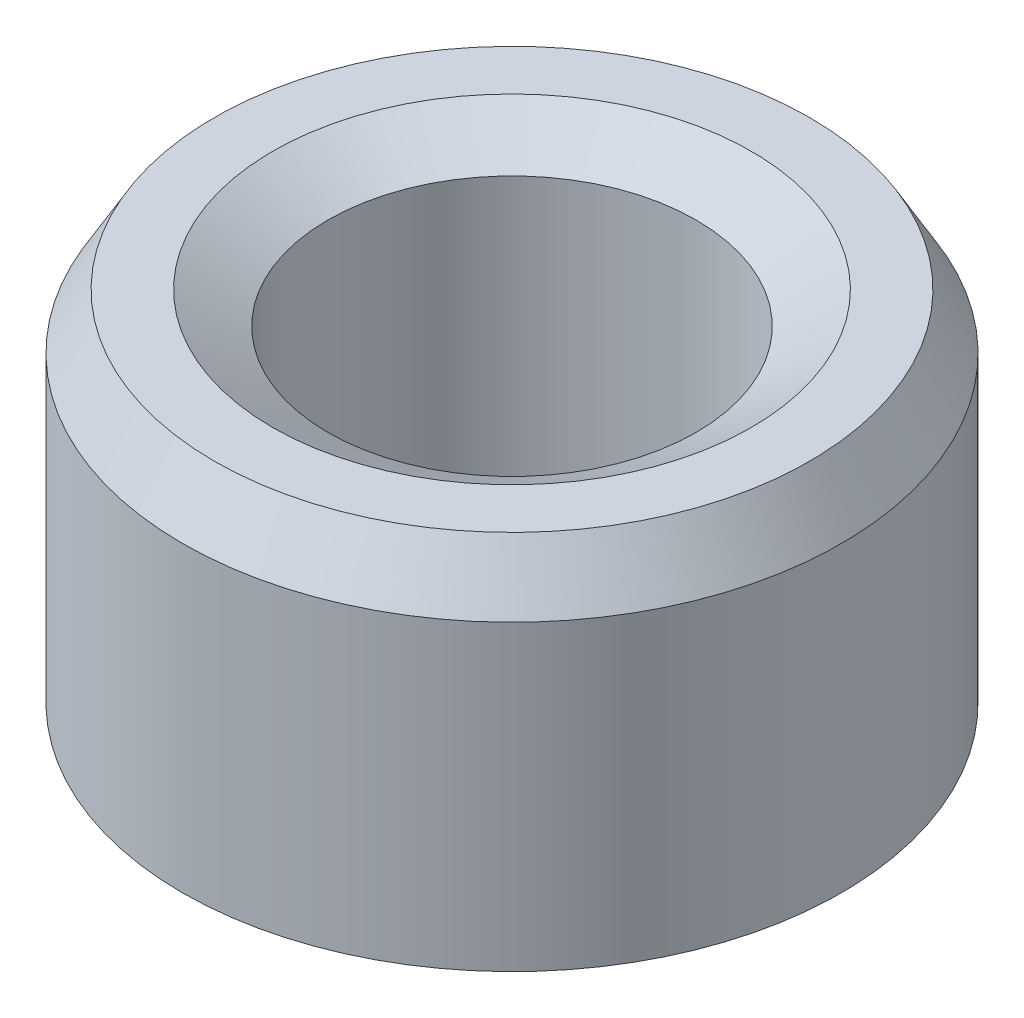
ISO-10303-21;
HEADER;
FILE_DESCRIPTION(('STEP AP214'),'2;1');
FILE_NAME('part.step','',(''),(''),'','','');
FILE_SCHEMA(('AUTOMOTIVE_DESIGN { 1 0 10303 214 1 1 1 1 }'));
ENDSEC;
DATA;
#1=APPLICATION_CONTEXT('core data for automotive mechanical design processes');
#2=APPLICATION_PROTOCOL_DEFINITION('international standard','automotive_design',2000,#1);
#3=PRODUCT_CONTEXT('',#1,'mechanical');
#4=PRODUCT('Part','Part','',(#3));
#5=PRODUCT_RELATED_PRODUCT_CATEGORY('part','',(#4));
#6=PRODUCT_DEFINITION_FORMATION('','',#4);
#7=PRODUCT_DEFINITION_CONTEXT('part definition',#1,'design');
#8=PRODUCT_DEFINITION('design','',#6,#7);
#9=PRODUCT_DEFINITION_SHAPE('','',#8);
#10=(LENGTH_UNIT() NAMED_UNIT(*) SI_UNIT(.MILLI.,.METRE.));
#11=(NAMED_UNIT(*) PLANE_ANGLE_UNIT() SI_UNIT($,.RADIAN.));
#12=(NAMED_UNIT(*) SI_UNIT($,.STERADIAN.) SOLID_ANGLE_UNIT());
#13=UNCERTAINTY_MEASURE_WITH_UNIT(LENGTH_MEASURE(1.E-05),#10,'distance_accuracy_value','');
#14=(GEOMETRIC_REPRESENTATION_CONTEXT(3) GLOBAL_UNCERTAINTY_ASSIGNED_CONTEXT((#13)) GLOBAL_UNIT_ASSIGNED_CONTEXT((#10,
#11,#12)) REPRESENTATION_CONTEXT('',''));
#15=CARTESIAN_POINT('',(0.,0.,0.));
#16=DIRECTION('',(0.,0.,1.));
#17=DIRECTION('',(1.,0.,0.));
#18=AXIS2_PLACEMENT_3D('',#15,#16,#17);
#19=CARTESIAN_POINT('',(0.,20.6948768826001,0.));
#20=DIRECTION('',(0.,-1.,0.));
#21=DIRECTION('',(0.,0.,-1.));
#22=AXIS2_PLACEMENT_3D('',#19,#20,#21);
#23=CYLINDRICAL_SURFACE('',#22,17.5);
#24=CARTESIAN_POINT('',(0.,1.69385494766244,0.));
#25=DIRECTION('',(0.,1.,0.));
#26=DIRECTION('',(0.,0.,1.));
#27=AXIS2_PLACEMENT_3D('',#24,#25,#26);
#28=CIRCLE('',#27,17.5);
#29=CARTESIAN_POINT('',(0.,1.69385494766244,17.5));
#30=VERTEX_POINT('',#29);
#31=EDGE_CURVE('E10',#30,#30,#28,.T.);
#32=ORIENTED_EDGE('',*,*,#31,.T.);
#33=EDGE_LOOP('',(#32));
#34=FACE_BOUND('',#33,.T.);
#35=CARTESIAN_POINT('',(0.,17.7610340525968,0.));
#36=DIRECTION('',(0.,1.,0.));
#37=DIRECTION('',(0.,0.,1.));
#38=AXIS2_PLACEMENT_3D('',#35,#36,#37);
#39=CIRCLE('',#38,17.5);
#40=CARTESIAN_POINT('',(0.,17.7610340525968,17.5));
#41=VERTEX_POINT('',#40);
#42=EDGE_CURVE('E50',#41,#41,#39,.F.);
#43=ORIENTED_EDGE('',*,*,#42,.T.);
#44=EDGE_LOOP('',(#43));
#45=FACE_BOUND('',#44,.T.);
#46=ADVANCED_FACE('F39',(#34,#45),#23,.T.);
#47=CARTESIAN_POINT('',(0.,20.6948768826001,0.));
#48=DIRECTION('',(0.,1.,0.));
#49=DIRECTION('',(0.,0.,1.));
#50=AXIS2_PLACEMENT_3D('',#47,#48,#49);
#51=PLANE('',#50);
#52=CARTESIAN_POINT('',(0.,20.6948768826001,0.));
#53=DIRECTION('',(0.,1.,0.));
#54=DIRECTION('',(0.,0.,1.));
#55=AXIS2_PLACEMENT_3D('',#52,#53,#54);
#56=CIRCLE('',#55,12.7076593594767);
#57=CARTESIAN_POINT('',(0.,20.6948768826001,12.7076593594767));
#58=VERTEX_POINT('',#57);
#59=EDGE_CURVE('E58',#58,#58,#56,.F.);
#60=ORIENTED_EDGE('',*,*,#59,.T.);
#61=EDGE_LOOP('',(#60));
#62=FACE_BOUND('',#61,.T.);
#63=CARTESIAN_POINT('',(0.,20.6948768826001,0.));
#64=DIRECTION('',(0.,1.,0.));
#65=DIRECTION('',(0.,0.,1.));
#66=AXIS2_PLACEMENT_3D('',#63,#64,#65);
#67=CIRCLE('',#66,15.8061450523376);
#68=CARTESIAN_POINT('',(0.,20.6948768826001,15.8061450523376));
#69=VERTEX_POINT('',#68);
#70=EDGE_CURVE('E61',#69,#69,#67,.T.);
#71=ORIENTED_EDGE('',*,*,#70,.T.);
#72=EDGE_LOOP('',(#71));
#73=FACE_BOUND('',#72,.T.);
#74=ADVANCED_FACE('F88',(#62,#73),#51,.T.);
#75=CARTESIAN_POINT('',(0.,0.,0.));
#76=DIRECTION('',(0.,1.,0.));
#77=DIRECTION('',(0.,0.,1.));
#78=AXIS2_PLACEMENT_3D('',#75,#76,#77);
#79=PLANE('',#78);
#80=CARTESIAN_POINT('',(0.,0.,0.));
#81=DIRECTION('',(0.,1.,0.));
#82=DIRECTION('',(0.,0.,1.));
#83=AXIS2_PLACEMENT_3D('',#80,#81,#82);
#84=CIRCLE('',#83,11.4676714771358);
#85=CARTESIAN_POINT('',(0.,0.,11.4676714771358));
#86=VERTEX_POINT('',#85);
#87=EDGE_CURVE('E51',#86,#86,#84,.T.);
#88=ORIENTED_EDGE('',*,*,#87,.T.);
#89=EDGE_LOOP('',(#88));
#90=FACE_BOUND('',#89,.T.);
#91=CARTESIAN_POINT('',(0.,0.,0.));
#92=DIRECTION('',(0.,1.,0.));
#93=DIRECTION('',(0.,0.,1.));
#94=AXIS2_PLACEMENT_3D('',#91,#92,#93);
#95=CIRCLE('',#94,14.5661571699967);
#96=CARTESIAN_POINT('',(0.,0.,14.5661571699967));
#97=VERTEX_POINT('',#96);
#98=EDGE_CURVE('E54',#97,#97,#95,.F.);
#99=ORIENTED_EDGE('',*,*,#98,.T.);
#100=EDGE_LOOP('',(#99));
#101=FACE_BOUND('',#100,.T.);
#102=ADVANCED_FACE('F83',(#90,#101),#79,.F.);
#103=CARTESIAN_POINT('',(0.,20.6948768826001,0.));
#104=DIRECTION('',(0.,-1.,0.));
#105=DIRECTION('',(0.,0.,-1.));
#106=AXIS2_PLACEMENT_3D('',#103,#104,#105);
#107=CYLINDRICAL_SURFACE('',#106,9.77381652947338);
#108=CARTESIAN_POINT('',(0.,19.0010219349377,0.));
#109=DIRECTION('',(0.,1.,0.));
#110=DIRECTION('',(0.,0.,1.));
#111=AXIS2_PLACEMENT_3D('',#108,#109,#110);
#112=CIRCLE('',#111,9.77381652947338);
#113=CARTESIAN_POINT('',(0.,19.0010219349377,9.77381652947338));
#114=VERTEX_POINT('',#113);
#115=EDGE_CURVE('E67',#114,#114,#112,.T.);
#116=ORIENTED_EDGE('',*,*,#115,.T.);
#117=EDGE_LOOP('',(#116));
#118=FACE_BOUND('',#117,.T.);
#119=CARTESIAN_POINT('',(0.,2.93384283000329,0.));
#120=DIRECTION('',(0.,1.,0.));
#121=DIRECTION('',(0.,0.,1.));
#122=AXIS2_PLACEMENT_3D('',#119,#120,#121);
#123=CIRCLE('',#122,9.77381652947338);
#124=CARTESIAN_POINT('',(0.,2.93384283000329,9.77381652947338));
#125=VERTEX_POINT('',#124);
#126=EDGE_CURVE('E69',#125,#125,#123,.F.);
#127=ORIENTED_EDGE('',*,*,#126,.T.);
#128=EDGE_LOOP('',(#127));
#129=FACE_BOUND('',#128,.T.);
#130=ADVANCED_FACE('F71',(#118,#129),#107,.F.);
#131=CARTESIAN_POINT('',(0.,19.0010219349377,0.));
#132=DIRECTION('',(0.,1.,0.));
#133=DIRECTION('',(0.,0.,1.));
#134=AXIS2_PLACEMENT_3D('',#131,#132,#133);
#135=CONICAL_SURFACE('',#134,9.77381652947338,1.0471975511966);
#136=ORIENTED_EDGE('',*,*,#59,.F.);
#137=EDGE_LOOP('',(#136));
#138=FACE_BOUND('',#137,.T.);
#139=ORIENTED_EDGE('',*,*,#115,.F.);
#140=EDGE_LOOP('',(#139));
#141=FACE_BOUND('',#140,.T.);
#142=ADVANCED_FACE('F77',(#138,#141),#135,.F.);
#143=CARTESIAN_POINT('',(0.,0.,0.));
#144=DIRECTION('',(0.,-1.,0.));
#145=DIRECTION('',(0.,0.,-1.));
#146=AXIS2_PLACEMENT_3D('',#143,#144,#145);
#147=CONICAL_SURFACE('',#146,11.4676714771358,0.523598775598295);
#148=ORIENTED_EDGE('',*,*,#126,.F.);
#149=EDGE_LOOP('',(#148));
#150=FACE_BOUND('',#149,.T.);
#151=ORIENTED_EDGE('',*,*,#87,.F.);
#152=EDGE_LOOP('',(#151));
#153=FACE_BOUND('',#152,.T.);
#154=ADVANCED_FACE('F73',(#150,#153),#147,.F.);
#155=CARTESIAN_POINT('',(0.,1.69385494766244,0.));
#156=DIRECTION('',(0.,1.,0.));
#157=DIRECTION('',(0.,0.,1.));
#158=AXIS2_PLACEMENT_3D('',#155,#156,#157);
#159=CONICAL_SURFACE('',#158,17.5,1.0471975511966);
#160=ORIENTED_EDGE('',*,*,#98,.F.);
#161=EDGE_LOOP('',(#160));
#162=FACE_BOUND('',#161,.T.);
#163=ORIENTED_EDGE('',*,*,#31,.F.);
#164=EDGE_LOOP('',(#163));
#165=FACE_BOUND('',#164,.T.);
#166=ADVANCED_FACE('F76',(#162,#165),#159,.T.);
#167=CARTESIAN_POINT('',(0.,20.6948768826001,0.));
#168=DIRECTION('',(0.,-1.,0.));
#169=DIRECTION('',(0.,0.,-1.));
#170=AXIS2_PLACEMENT_3D('',#167,#168,#169);
#171=CONICAL_SURFACE('',#170,15.8061450523376,0.523598775598297);
#172=ORIENTED_EDGE('',*,*,#42,.F.);
#173=EDGE_LOOP('',(#172));
#174=FACE_BOUND('',#173,.T.);
#175=ORIENTED_EDGE('',*,*,#70,.F.);
#176=EDGE_LOOP('',(#175));
#177=FACE_BOUND('',#176,.T.);
#178=ADVANCED_FACE('F45',(#174,#177),#171,.T.);
#179=CLOSED_SHELL('',(#46,#74,#102,#130,#142,#154,#166,#178));
#180=MANIFOLD_SOLID_BREP('B2',#179);
#181=ADVANCED_BREP_SHAPE_REPRESENTATION('',(#18,#180),#14);
#182=SHAPE_DEFINITION_REPRESENTATION(#9,#181);
ENDSEC;
END-ISO-10303-21;
